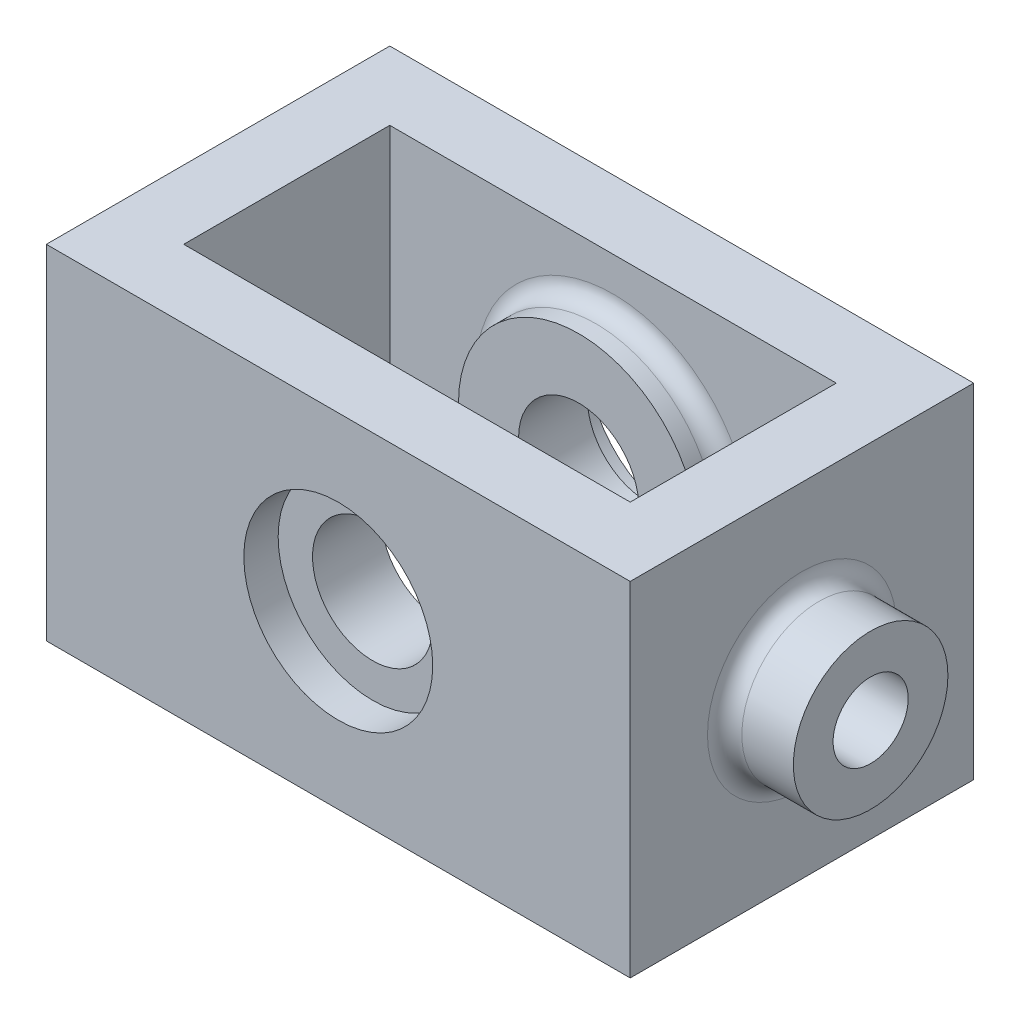
ISO-10303-21;
HEADER;
FILE_DESCRIPTION(('STEP AP214'),'2;1');
FILE_NAME('part.step','',(''),(''),'','','');
FILE_SCHEMA(('AUTOMOTIVE_DESIGN { 1 0 10303 214 1 1 1 1 }'));
ENDSEC;
DATA;
#1=APPLICATION_CONTEXT('core data for automotive mechanical design processes');
#2=APPLICATION_PROTOCOL_DEFINITION('international standard','automotive_design',2000,#1);
#3=PRODUCT_CONTEXT('',#1,'mechanical');
#4=PRODUCT('Part','Part','',(#3));
#5=PRODUCT_RELATED_PRODUCT_CATEGORY('part','',(#4));
#6=PRODUCT_DEFINITION_FORMATION('','',#4);
#7=PRODUCT_DEFINITION_CONTEXT('part definition',#1,'design');
#8=PRODUCT_DEFINITION('design','',#6,#7);
#9=PRODUCT_DEFINITION_SHAPE('','',#8);
#10=(LENGTH_UNIT() NAMED_UNIT(*) SI_UNIT(.MILLI.,.METRE.));
#11=(NAMED_UNIT(*) PLANE_ANGLE_UNIT() SI_UNIT($,.RADIAN.));
#12=(NAMED_UNIT(*) SI_UNIT($,.STERADIAN.) SOLID_ANGLE_UNIT());
#13=UNCERTAINTY_MEASURE_WITH_UNIT(LENGTH_MEASURE(1.E-05),#10,'distance_accuracy_value','');
#14=(GEOMETRIC_REPRESENTATION_CONTEXT(3) GLOBAL_UNCERTAINTY_ASSIGNED_CONTEXT((#13)) GLOBAL_UNIT_ASSIGNED_CONTEXT((#10,
#11,#12)) REPRESENTATION_CONTEXT('',''));
#15=CARTESIAN_POINT('',(0.,0.,0.));
#16=DIRECTION('',(0.,0.,1.));
#17=DIRECTION('',(1.,0.,0.));
#18=AXIS2_PLACEMENT_3D('',#15,#16,#17);
#19=CARTESIAN_POINT('',(0.,0.,25.4));
#20=DIRECTION('',(0.,0.,-1.));
#21=DIRECTION('',(-1.,0.,0.));
#22=AXIS2_PLACEMENT_3D('',#19,#20,#21);
#23=CYLINDRICAL_SURFACE('',#22,8.89);
#24=CARTESIAN_POINT('',(0.,0.,20.32));
#25=DIRECTION('',(0.,0.,1.));
#26=DIRECTION('',(1.,0.,0.));
#27=AXIS2_PLACEMENT_3D('',#24,#25,#26);
#28=CIRCLE('',#27,8.89);
#29=CARTESIAN_POINT('',(8.89000000000003,0.,20.32));
#30=VERTEX_POINT('',#29);
#31=EDGE_CURVE('E231',#30,#30,#28,.T.);
#32=ORIENTED_EDGE('',*,*,#31,.T.);
#33=EDGE_LOOP('',(#32));
#34=FACE_BOUND('',#33,.T.);
#35=CARTESIAN_POINT('',(0.,0.,10.16));
#36=DIRECTION('',(0.,0.,1.));
#37=DIRECTION('',(1.,0.,0.));
#38=AXIS2_PLACEMENT_3D('',#35,#36,#37);
#39=CIRCLE('',#38,8.89);
#40=CARTESIAN_POINT('',(8.89000000000003,0.,10.16));
#41=VERTEX_POINT('',#40);
#42=EDGE_CURVE('E368',#41,#41,#39,.T.);
#43=ORIENTED_EDGE('',*,*,#42,.F.);
#44=EDGE_LOOP('',(#43));
#45=FACE_BOUND('',#44,.T.);
#46=ADVANCED_FACE('F87',(#34,#45),#23,.F.);
#47=CARTESIAN_POINT('',(0.,0.,-25.4));
#48=DIRECTION('',(0.,0.,1.));
#49=DIRECTION('',(1.,0.,0.));
#50=AXIS2_PLACEMENT_3D('',#47,#48,#49);
#51=PLANE('',#50);
#52=DIRECTION('',(0.,-1.,0.));
#53=VECTOR('',#52,1.);
#54=CARTESIAN_POINT('',(43.18,0.,-25.4));
#55=LINE('',#54,#53);
#56=CARTESIAN_POINT('',(43.18,25.4,-25.4));
#57=VERTEX_POINT('',#56);
#58=CARTESIAN_POINT('',(43.18,-25.4,-25.4));
#59=VERTEX_POINT('',#58);
#60=EDGE_CURVE('E243',#57,#59,#55,.T.);
#61=ORIENTED_EDGE('',*,*,#60,.T.);
#62=DIRECTION('',(1.,0.,0.));
#63=VECTOR('',#62,1.);
#64=CARTESIAN_POINT('',(0.,-25.4,-25.4));
#65=LINE('',#64,#63);
#66=CARTESIAN_POINT('',(-43.18,-25.4,-25.4));
#67=VERTEX_POINT('',#66);
#68=EDGE_CURVE('E252',#67,#59,#65,.T.);
#69=ORIENTED_EDGE('',*,*,#68,.F.);
#70=DIRECTION('',(0.,-1.,0.));
#71=VECTOR('',#70,1.);
#72=CARTESIAN_POINT('',(-43.18,0.,-25.4));
#73=LINE('',#72,#71);
#74=CARTESIAN_POINT('',(-43.18,25.4,-25.4));
#75=VERTEX_POINT('',#74);
#76=EDGE_CURVE('E271',#75,#67,#73,.T.);
#77=ORIENTED_EDGE('',*,*,#76,.F.);
#78=DIRECTION('',(1.,0.,0.));
#79=VECTOR('',#78,1.);
#80=CARTESIAN_POINT('',(0.,25.4,-25.4));
#81=LINE('',#80,#79);
#82=EDGE_CURVE('E267',#75,#57,#81,.T.);
#83=ORIENTED_EDGE('',*,*,#82,.T.);
#84=EDGE_LOOP('',(#61,#69,#77,#83));
#85=FACE_BOUND('',#84,.T.);
#86=CARTESIAN_POINT('',(0.,0.,-25.4));
#87=DIRECTION('',(0.,0.,1.));
#88=DIRECTION('',(1.,0.,0.));
#89=AXIS2_PLACEMENT_3D('',#86,#87,#88);
#90=CIRCLE('',#89,13.97);
#91=CARTESIAN_POINT('',(13.97,0.,-25.4));
#92=VERTEX_POINT('',#91);
#93=EDGE_CURVE('E226',#92,#92,#90,.T.);
#94=ORIENTED_EDGE('',*,*,#93,.T.);
#95=EDGE_LOOP('',(#94));
#96=FACE_BOUND('',#95,.T.);
#97=ADVANCED_FACE('F336',(#85,#96),#51,.F.);
#98=CARTESIAN_POINT('',(0.,0.,-20.32));
#99=DIRECTION('',(0.,0.,1.));
#100=DIRECTION('',(1.,0.,0.));
#101=AXIS2_PLACEMENT_3D('',#98,#99,#100);
#102=CIRCLE('',#101,8.89);
#103=CARTESIAN_POINT('',(8.89000000000003,0.,-20.32));
#104=VERTEX_POINT('',#103);
#105=EDGE_CURVE('E222',#104,#104,#102,.T.);
#106=ORIENTED_EDGE('',*,*,#105,.F.);
#107=EDGE_LOOP('',(#106));
#108=FACE_BOUND('',#107,.T.);
#109=CARTESIAN_POINT('',(0.,0.,-10.16));
#110=DIRECTION('',(0.,0.,-1.));
#111=DIRECTION('',(-1.,0.,0.));
#112=AXIS2_PLACEMENT_3D('',#109,#110,#111);
#113=CIRCLE('',#112,8.89);
#114=CARTESIAN_POINT('',(-8.88999999999997,0.,-10.16));
#115=VERTEX_POINT('',#114);
#116=EDGE_CURVE('E361',#115,#115,#113,.T.);
#117=ORIENTED_EDGE('',*,*,#116,.F.);
#118=EDGE_LOOP('',(#117));
#119=FACE_BOUND('',#118,.T.);
#120=ADVANCED_FACE('F339',(#108,#119),#23,.F.);
#121=CARTESIAN_POINT('',(0.,25.4,25.4));
#122=DIRECTION('',(0.,1.,0.));
#123=DIRECTION('',(-1.,0.,0.));
#124=AXIS2_PLACEMENT_3D('',#121,#122,#123);
#125=PLANE('',#124);
#126=DIRECTION('',(0.,0.,-1.));
#127=VECTOR('',#126,1.);
#128=CARTESIAN_POINT('',(33.02,25.4,-15.24));
#129=LINE('',#128,#127);
#130=CARTESIAN_POINT('',(33.02,25.4,15.24));
#131=VERTEX_POINT('',#130);
#132=CARTESIAN_POINT('',(33.02,25.4,-15.24));
#133=VERTEX_POINT('',#132);
#134=EDGE_CURVE('E103',#131,#133,#129,.T.);
#135=ORIENTED_EDGE('',*,*,#134,.F.);
#136=DIRECTION('',(1.,0.,0.));
#137=VECTOR('',#136,1.);
#138=CARTESIAN_POINT('',(-33.02,25.4,15.24));
#139=LINE('',#138,#137);
#140=CARTESIAN_POINT('',(-33.02,25.4,15.24));
#141=VERTEX_POINT('',#140);
#142=EDGE_CURVE('E174',#141,#131,#139,.T.);
#143=ORIENTED_EDGE('',*,*,#142,.F.);
#144=DIRECTION('',(0.,0.,1.));
#145=VECTOR('',#144,1.);
#146=CARTESIAN_POINT('',(-33.02,25.4,-15.24));
#147=LINE('',#146,#145);
#148=CARTESIAN_POINT('',(-33.02,25.4,-15.24));
#149=VERTEX_POINT('',#148);
#150=EDGE_CURVE('E178',#149,#141,#147,.T.);
#151=ORIENTED_EDGE('',*,*,#150,.F.);
#152=DIRECTION('',(-1.,0.,0.));
#153=VECTOR('',#152,1.);
#154=CARTESIAN_POINT('',(-33.02,25.4,-15.24));
#155=LINE('',#154,#153);
#156=EDGE_CURVE('E190',#133,#149,#155,.T.);
#157=ORIENTED_EDGE('',*,*,#156,.F.);
#158=EDGE_LOOP('',(#135,#143,#151,#157));
#159=FACE_BOUND('',#158,.T.);
#160=ORIENTED_EDGE('',*,*,#82,.F.);
#161=DIRECTION('',(0.,0.,-1.));
#162=VECTOR('',#161,1.);
#163=CARTESIAN_POINT('',(-43.18,25.4,25.4));
#164=LINE('',#163,#162);
#165=CARTESIAN_POINT('',(-43.18,25.4,25.4));
#166=VERTEX_POINT('',#165);
#167=EDGE_CURVE('E284',#166,#75,#164,.T.);
#168=ORIENTED_EDGE('',*,*,#167,.F.);
#169=DIRECTION('',(1.,0.,0.));
#170=VECTOR('',#169,1.);
#171=CARTESIAN_POINT('',(0.,25.4,25.4));
#172=LINE('',#171,#170);
#173=CARTESIAN_POINT('',(43.18,25.4,25.4));
#174=VERTEX_POINT('',#173);
#175=EDGE_CURVE('E251',#166,#174,#172,.T.);
#176=ORIENTED_EDGE('',*,*,#175,.T.);
#177=DIRECTION('',(0.,0.,-1.));
#178=VECTOR('',#177,1.);
#179=CARTESIAN_POINT('',(43.18,25.4,25.4));
#180=LINE('',#179,#178);
#181=EDGE_CURVE('E287',#174,#57,#180,.T.);
#182=ORIENTED_EDGE('',*,*,#181,.T.);
#183=EDGE_LOOP('',(#160,#168,#176,#182));
#184=FACE_BOUND('',#183,.T.);
#185=ADVANCED_FACE('F349',(#159,#184),#125,.T.);
#186=CARTESIAN_POINT('',(-43.18,0.,25.4));
#187=DIRECTION('',(1.,0.,0.));
#188=DIRECTION('',(0.,1.,0.));
#189=AXIS2_PLACEMENT_3D('',#186,#187,#188);
#190=PLANE('',#189);
#191=CARTESIAN_POINT('',(-43.18,0.,0.));
#192=DIRECTION('',(1.,0.,0.));
#193=DIRECTION('',(0.,1.,0.));
#194=AXIS2_PLACEMENT_3D('',#191,#192,#193);
#195=CIRCLE('',#194,13.97);
#196=CARTESIAN_POINT('',(-43.18,13.97,0.));
#197=VERTEX_POINT('',#196);
#198=EDGE_CURVE('E312',#197,#197,#195,.T.);
#199=ORIENTED_EDGE('',*,*,#198,.T.);
#200=EDGE_LOOP('',(#199));
#201=FACE_BOUND('',#200,.T.);
#202=ORIENTED_EDGE('',*,*,#76,.T.);
#203=DIRECTION('',(0.,0.,-1.));
#204=VECTOR('',#203,1.);
#205=CARTESIAN_POINT('',(-43.18,-25.4,25.4));
#206=LINE('',#205,#204);
#207=CARTESIAN_POINT('',(-43.18,-25.4,25.4));
#208=VERTEX_POINT('',#207);
#209=EDGE_CURVE('E280',#208,#67,#206,.T.);
#210=ORIENTED_EDGE('',*,*,#209,.F.);
#211=DIRECTION('',(0.,-1.,0.));
#212=VECTOR('',#211,1.);
#213=CARTESIAN_POINT('',(-43.18,0.,25.4));
#214=LINE('',#213,#212);
#215=EDGE_CURVE('E256',#166,#208,#214,.T.);
#216=ORIENTED_EDGE('',*,*,#215,.F.);
#217=ORIENTED_EDGE('',*,*,#167,.T.);
#218=EDGE_LOOP('',(#202,#210,#216,#217));
#219=FACE_BOUND('',#218,.T.);
#220=ADVANCED_FACE('F354',(#201,#219),#190,.F.);
#221=CARTESIAN_POINT('',(0.,-25.4,25.4));
#222=DIRECTION('',(0.,1.,0.));
#223=DIRECTION('',(0.,0.,1.));
#224=AXIS2_PLACEMENT_3D('',#221,#222,#223);
#225=PLANE('',#224);
#226=DIRECTION('',(1.,0.,0.));
#227=VECTOR('',#226,1.);
#228=CARTESIAN_POINT('',(-33.02,-25.4,15.24));
#229=LINE('',#228,#227);
#230=CARTESIAN_POINT('',(-33.02,-25.4,15.24));
#231=VERTEX_POINT('',#230);
#232=CARTESIAN_POINT('',(33.02,-25.4,15.24));
#233=VERTEX_POINT('',#232);
#234=EDGE_CURVE('E162',#231,#233,#229,.T.);
#235=ORIENTED_EDGE('',*,*,#234,.T.);
#236=DIRECTION('',(0.,0.,-1.));
#237=VECTOR('',#236,1.);
#238=CARTESIAN_POINT('',(33.02,-25.4,-15.24));
#239=LINE('',#238,#237);
#240=CARTESIAN_POINT('',(33.02,-25.4,-15.24));
#241=VERTEX_POINT('',#240);
#242=EDGE_CURVE('E155',#233,#241,#239,.T.);
#243=ORIENTED_EDGE('',*,*,#242,.T.);
#244=DIRECTION('',(-1.,0.,0.));
#245=VECTOR('',#244,1.);
#246=CARTESIAN_POINT('',(-33.02,-25.4,-15.24));
#247=LINE('',#246,#245);
#248=CARTESIAN_POINT('',(-33.02,-25.4,-15.24));
#249=VERTEX_POINT('',#248);
#250=EDGE_CURVE('E165',#241,#249,#247,.T.);
#251=ORIENTED_EDGE('',*,*,#250,.T.);
#252=DIRECTION('',(0.,0.,1.));
#253=VECTOR('',#252,1.);
#254=CARTESIAN_POINT('',(-33.02,-25.4,-15.24));
#255=LINE('',#254,#253);
#256=EDGE_CURVE('E111',#249,#231,#255,.T.);
#257=ORIENTED_EDGE('',*,*,#256,.T.);
#258=EDGE_LOOP('',(#235,#243,#251,#257));
#259=FACE_BOUND('',#258,.T.);
#260=ORIENTED_EDGE('',*,*,#68,.T.);
#261=DIRECTION('',(0.,0.,-1.));
#262=VECTOR('',#261,1.);
#263=CARTESIAN_POINT('',(43.18,-25.4,25.4));
#264=LINE('',#263,#262);
#265=CARTESIAN_POINT('',(43.18,-25.4,25.4));
#266=VERTEX_POINT('',#265);
#267=EDGE_CURVE('E263',#266,#59,#264,.T.);
#268=ORIENTED_EDGE('',*,*,#267,.F.);
#269=DIRECTION('',(1.,0.,0.));
#270=VECTOR('',#269,1.);
#271=CARTESIAN_POINT('',(0.,-25.4,25.4));
#272=LINE('',#271,#270);
#273=EDGE_CURVE('E260',#208,#266,#272,.T.);
#274=ORIENTED_EDGE('',*,*,#273,.F.);
#275=ORIENTED_EDGE('',*,*,#209,.T.);
#276=EDGE_LOOP('',(#260,#268,#274,#275));
#277=FACE_BOUND('',#276,.T.);
#278=ADVANCED_FACE('F170',(#259,#277),#225,.F.);
#279=CARTESIAN_POINT('',(43.18,0.,25.4));
#280=DIRECTION('',(1.,0.,0.));
#281=DIRECTION('',(0.,0.,-1.));
#282=AXIS2_PLACEMENT_3D('',#279,#280,#281);
#283=PLANE('',#282);
#284=CARTESIAN_POINT('',(43.18,0.,0.));
#285=DIRECTION('',(1.,0.,0.));
#286=DIRECTION('',(0.,0.,-1.));
#287=AXIS2_PLACEMENT_3D('',#284,#285,#286);
#288=CIRCLE('',#287,13.97);
#289=CARTESIAN_POINT('',(43.18,0.,-13.97));
#290=VERTEX_POINT('',#289);
#291=EDGE_CURVE('E12',#290,#290,#288,.F.);
#292=ORIENTED_EDGE('',*,*,#291,.T.);
#293=EDGE_LOOP('',(#292));
#294=FACE_BOUND('',#293,.T.);
#295=ORIENTED_EDGE('',*,*,#60,.F.);
#296=ORIENTED_EDGE('',*,*,#181,.F.);
#297=DIRECTION('',(0.,-1.,0.));
#298=VECTOR('',#297,1.);
#299=CARTESIAN_POINT('',(43.18,0.,25.4));
#300=LINE('',#299,#298);
#301=EDGE_CURVE('E247',#174,#266,#300,.T.);
#302=ORIENTED_EDGE('',*,*,#301,.T.);
#303=ORIENTED_EDGE('',*,*,#267,.T.);
#304=EDGE_LOOP('',(#295,#296,#302,#303));
#305=FACE_BOUND('',#304,.T.);
#306=ADVANCED_FACE('F448',(#294,#305),#283,.T.);
#307=CARTESIAN_POINT('',(0.,0.,25.4));
#308=DIRECTION('',(0.,0.,1.));
#309=DIRECTION('',(1.,0.,0.));
#310=AXIS2_PLACEMENT_3D('',#307,#308,#309);
#311=PLANE('',#310);
#312=CARTESIAN_POINT('',(0.,0.,25.4));
#313=DIRECTION('',(0.,0.,1.));
#314=DIRECTION('',(1.,0.,0.));
#315=AXIS2_PLACEMENT_3D('',#312,#313,#314);
#316=CIRCLE('',#315,13.97);
#317=CARTESIAN_POINT('',(13.97,0.,25.4));
#318=VERTEX_POINT('',#317);
#319=EDGE_CURVE('E238',#318,#318,#316,.T.);
#320=ORIENTED_EDGE('',*,*,#319,.F.);
#321=EDGE_LOOP('',(#320));
#322=FACE_BOUND('',#321,.T.);
#323=ORIENTED_EDGE('',*,*,#301,.F.);
#324=ORIENTED_EDGE('',*,*,#175,.F.);
#325=ORIENTED_EDGE('',*,*,#215,.T.);
#326=ORIENTED_EDGE('',*,*,#273,.T.);
#327=EDGE_LOOP('',(#323,#324,#325,#326));
#328=FACE_BOUND('',#327,.T.);
#329=ADVANCED_FACE('F445',(#322,#328),#311,.T.);
#330=CARTESIAN_POINT('',(0.,0.,20.32));
#331=DIRECTION('',(0.,0.,1.));
#332=DIRECTION('',(1.,0.,0.));
#333=AXIS2_PLACEMENT_3D('',#330,#331,#332);
#334=CYLINDRICAL_SURFACE('',#333,13.97);
#335=CARTESIAN_POINT('',(0.,0.,20.32));
#336=DIRECTION('',(0.,0.,1.));
#337=DIRECTION('',(1.,0.,0.));
#338=AXIS2_PLACEMENT_3D('',#335,#336,#337);
#339=CIRCLE('',#338,13.97);
#340=CARTESIAN_POINT('',(13.97,0.,20.32));
#341=VERTEX_POINT('',#340);
#342=EDGE_CURVE('E239',#341,#341,#339,.T.);
#343=ORIENTED_EDGE('',*,*,#342,.F.);
#344=EDGE_LOOP('',(#343));
#345=FACE_BOUND('',#344,.T.);
#346=ORIENTED_EDGE('',*,*,#319,.T.);
#347=EDGE_LOOP('',(#346));
#348=FACE_BOUND('',#347,.T.);
#349=ADVANCED_FACE('F441',(#345,#348),#334,.F.);
#350=CARTESIAN_POINT('',(0.,0.,20.32));
#351=DIRECTION('',(0.,0.,1.));
#352=DIRECTION('',(1.,0.,0.));
#353=AXIS2_PLACEMENT_3D('',#350,#351,#352);
#354=PLANE('',#353);
#355=ORIENTED_EDGE('',*,*,#31,.F.);
#356=EDGE_LOOP('',(#355));
#357=FACE_BOUND('',#356,.T.);
#358=ORIENTED_EDGE('',*,*,#342,.T.);
#359=EDGE_LOOP('',(#358));
#360=FACE_BOUND('',#359,.T.);
#361=ADVANCED_FACE('F434',(#357,#360),#354,.T.);
#362=CARTESIAN_POINT('',(0.,0.,-20.32));
#363=DIRECTION('',(0.,0.,1.));
#364=DIRECTION('',(1.,0.,0.));
#365=AXIS2_PLACEMENT_3D('',#362,#363,#364);
#366=PLANE('',#365);
#367=CARTESIAN_POINT('',(0.,0.,-20.32));
#368=DIRECTION('',(0.,0.,1.));
#369=DIRECTION('',(1.,0.,0.));
#370=AXIS2_PLACEMENT_3D('',#367,#368,#369);
#371=CIRCLE('',#370,13.97);
#372=CARTESIAN_POINT('',(13.97,0.,-20.32));
#373=VERTEX_POINT('',#372);
#374=EDGE_CURVE('E227',#373,#373,#371,.T.);
#375=ORIENTED_EDGE('',*,*,#374,.F.);
#376=EDGE_LOOP('',(#375));
#377=FACE_BOUND('',#376,.T.);
#378=ORIENTED_EDGE('',*,*,#105,.T.);
#379=EDGE_LOOP('',(#378));
#380=FACE_BOUND('',#379,.T.);
#381=ADVANCED_FACE('F431',(#377,#380),#366,.F.);
#382=CARTESIAN_POINT('',(0.,0.,-20.32));
#383=DIRECTION('',(0.,0.,-1.));
#384=DIRECTION('',(-1.,0.,0.));
#385=AXIS2_PLACEMENT_3D('',#382,#383,#384);
#386=CYLINDRICAL_SURFACE('',#385,13.97);
#387=ORIENTED_EDGE('',*,*,#374,.T.);
#388=EDGE_LOOP('',(#387));
#389=FACE_BOUND('',#388,.T.);
#390=ORIENTED_EDGE('',*,*,#93,.F.);
#391=EDGE_LOOP('',(#390));
#392=FACE_BOUND('',#391,.T.);
#393=ADVANCED_FACE('F427',(#389,#392),#386,.F.);
#394=CARTESIAN_POINT('',(53.34,0.,0.));
#395=DIRECTION('',(1.,0.,0.));
#396=DIRECTION('',(0.,0.,-1.));
#397=AXIS2_PLACEMENT_3D('',#394,#395,#396);
#398=PLANE('',#397);
#399=CARTESIAN_POINT('',(53.34,0.,0.));
#400=DIRECTION('',(1.,0.,0.));
#401=DIRECTION('',(0.,0.,-1.));
#402=AXIS2_PLACEMENT_3D('',#399,#400,#401);
#403=CIRCLE('',#402,11.43);
#404=CARTESIAN_POINT('',(53.34,0.,-11.43));
#405=VERTEX_POINT('',#404);
#406=EDGE_CURVE('E218',#405,#405,#403,.T.);
#407=ORIENTED_EDGE('',*,*,#406,.T.);
#408=EDGE_LOOP('',(#407));
#409=FACE_BOUND('',#408,.T.);
#410=CARTESIAN_POINT('',(53.34,0.,0.));
#411=DIRECTION('',(1.,0.,0.));
#412=DIRECTION('',(0.,0.,-1.));
#413=AXIS2_PLACEMENT_3D('',#410,#411,#412);
#414=CIRCLE('',#413,5.55625);
#415=CARTESIAN_POINT('',(53.34,0.,-5.55625));
#416=VERTEX_POINT('',#415);
#417=EDGE_CURVE('E214',#416,#416,#414,.T.);
#418=ORIENTED_EDGE('',*,*,#417,.F.);
#419=EDGE_LOOP('',(#418));
#420=FACE_BOUND('',#419,.T.);
#421=ADVANCED_FACE('F424',(#409,#420),#398,.T.);
#422=CARTESIAN_POINT('',(53.34,0.,0.));
#423=DIRECTION('',(-1.,0.,0.));
#424=DIRECTION('',(0.,0.,1.));
#425=AXIS2_PLACEMENT_3D('',#422,#423,#424);
#426=CYLINDRICAL_SURFACE('',#425,11.43);
#427=CARTESIAN_POINT('',(45.72,0.,0.));
#428=DIRECTION('',(1.,0.,0.));
#429=DIRECTION('',(0.,0.,-1.));
#430=AXIS2_PLACEMENT_3D('',#427,#428,#429);
#431=CIRCLE('',#430,11.43);
#432=CARTESIAN_POINT('',(45.72,0.,-11.43));
#433=VERTEX_POINT('',#432);
#434=EDGE_CURVE('E96',#433,#433,#431,.T.);
#435=ORIENTED_EDGE('',*,*,#434,.T.);
#436=EDGE_LOOP('',(#435));
#437=FACE_BOUND('',#436,.T.);
#438=ORIENTED_EDGE('',*,*,#406,.F.);
#439=EDGE_LOOP('',(#438));
#440=FACE_BOUND('',#439,.T.);
#441=ADVANCED_FACE('F323',(#437,#440),#426,.T.);
#442=CARTESIAN_POINT('',(53.34,0.,0.));
#443=DIRECTION('',(-1.,0.,0.));
#444=DIRECTION('',(0.,0.,1.));
#445=AXIS2_PLACEMENT_3D('',#442,#443,#444);
#446=CYLINDRICAL_SURFACE('',#445,5.55625);
#447=CARTESIAN_POINT('',(33.02,0.,0.));
#448=DIRECTION('',(1.,0.,0.));
#449=DIRECTION('',(0.,1.,0.));
#450=AXIS2_PLACEMENT_3D('',#447,#448,#449);
#451=CIRCLE('',#450,5.55625);
#452=CARTESIAN_POINT('',(33.02,5.55625,0.));
#453=VERTEX_POINT('',#452);
#454=EDGE_CURVE('E210',#453,#453,#451,.T.);
#455=ORIENTED_EDGE('',*,*,#454,.F.);
#456=EDGE_LOOP('',(#455));
#457=FACE_BOUND('',#456,.T.);
#458=ORIENTED_EDGE('',*,*,#417,.T.);
#459=EDGE_LOOP('',(#458));
#460=FACE_BOUND('',#459,.T.);
#461=ADVANCED_FACE('F419',(#457,#460),#446,.F.);
#462=CARTESIAN_POINT('',(-53.34,0.,0.));
#463=DIRECTION('',(1.,0.,0.));
#464=DIRECTION('',(0.,0.,-1.));
#465=AXIS2_PLACEMENT_3D('',#462,#463,#464);
#466=CYLINDRICAL_SURFACE('',#465,11.43);
#467=CARTESIAN_POINT('',(-45.72,0.,0.));
#468=DIRECTION('',(1.,0.,0.));
#469=DIRECTION('',(0.,1.,0.));
#470=AXIS2_PLACEMENT_3D('',#467,#468,#469);
#471=CIRCLE('',#470,11.43);
#472=CARTESIAN_POINT('',(-45.72,11.43,0.));
#473=VERTEX_POINT('',#472);
#474=EDGE_CURVE('E316',#473,#473,#471,.F.);
#475=ORIENTED_EDGE('',*,*,#474,.T.);
#476=EDGE_LOOP('',(#475));
#477=FACE_BOUND('',#476,.T.);
#478=CARTESIAN_POINT('',(-53.34,0.,0.));
#479=DIRECTION('',(1.,0.,0.));
#480=DIRECTION('',(0.,0.,-1.));
#481=AXIS2_PLACEMENT_3D('',#478,#479,#480);
#482=CIRCLE('',#481,11.43);
#483=CARTESIAN_POINT('',(-53.34,0.,-11.43));
#484=VERTEX_POINT('',#483);
#485=EDGE_CURVE('E209',#484,#484,#482,.T.);
#486=ORIENTED_EDGE('',*,*,#485,.T.);
#487=EDGE_LOOP('',(#486));
#488=FACE_BOUND('',#487,.T.);
#489=ADVANCED_FACE('F415',(#477,#488),#466,.T.);
#490=CARTESIAN_POINT('',(-53.34,0.,0.));
#491=DIRECTION('',(-1.,0.,0.));
#492=DIRECTION('',(0.,0.,-1.));
#493=AXIS2_PLACEMENT_3D('',#490,#491,#492);
#494=PLANE('',#493);
#495=CARTESIAN_POINT('',(-53.34,0.,0.));
#496=DIRECTION('',(1.,0.,0.));
#497=DIRECTION('',(0.,0.,-1.));
#498=AXIS2_PLACEMENT_3D('',#495,#496,#497);
#499=CIRCLE('',#498,5.55625);
#500=CARTESIAN_POINT('',(-53.34,0.,-5.55625));
#501=VERTEX_POINT('',#500);
#502=EDGE_CURVE('E205',#501,#501,#499,.T.);
#503=ORIENTED_EDGE('',*,*,#502,.T.);
#504=EDGE_LOOP('',(#503));
#505=FACE_BOUND('',#504,.T.);
#506=ORIENTED_EDGE('',*,*,#485,.F.);
#507=EDGE_LOOP('',(#506));
#508=FACE_BOUND('',#507,.T.);
#509=ADVANCED_FACE('F411',(#505,#508),#494,.T.);
#510=CARTESIAN_POINT('',(-53.34,0.,0.));
#511=DIRECTION('',(1.,0.,0.));
#512=DIRECTION('',(0.,0.,-1.));
#513=AXIS2_PLACEMENT_3D('',#510,#511,#512);
#514=CYLINDRICAL_SURFACE('',#513,5.55625);
#515=CARTESIAN_POINT('',(-33.02,0.,0.));
#516=DIRECTION('',(-1.,0.,0.));
#517=DIRECTION('',(0.,-1.,0.));
#518=AXIS2_PLACEMENT_3D('',#515,#516,#517);
#519=CIRCLE('',#518,5.55625);
#520=CARTESIAN_POINT('',(-33.02,-5.55625,0.));
#521=VERTEX_POINT('',#520);
#522=EDGE_CURVE('E199',#521,#521,#519,.F.);
#523=ORIENTED_EDGE('',*,*,#522,.T.);
#524=EDGE_LOOP('',(#523));
#525=FACE_BOUND('',#524,.T.);
#526=ORIENTED_EDGE('',*,*,#502,.F.);
#527=EDGE_LOOP('',(#526));
#528=FACE_BOUND('',#527,.T.);
#529=ADVANCED_FACE('F402',(#525,#528),#514,.F.);
#530=CARTESIAN_POINT('',(-33.02,-25.4,-15.24));
#531=DIRECTION('',(-1.,0.,0.));
#532=DIRECTION('',(0.,-1.,0.));
#533=AXIS2_PLACEMENT_3D('',#530,#531,#532);
#534=PLANE('',#533);
#535=ORIENTED_EDGE('',*,*,#150,.T.);
#536=DIRECTION('',(0.,1.,0.));
#537=VECTOR('',#536,1.);
#538=CARTESIAN_POINT('',(-33.02,-25.4,15.24));
#539=LINE('',#538,#537);
#540=EDGE_CURVE('E200',#231,#141,#539,.T.);
#541=ORIENTED_EDGE('',*,*,#540,.F.);
#542=ORIENTED_EDGE('',*,*,#256,.F.);
#543=DIRECTION('',(0.,1.,0.));
#544=VECTOR('',#543,1.);
#545=CARTESIAN_POINT('',(-33.02,-25.4,-15.24));
#546=LINE('',#545,#544);
#547=EDGE_CURVE('E161',#249,#149,#546,.T.);
#548=ORIENTED_EDGE('',*,*,#547,.T.);
#549=EDGE_LOOP('',(#535,#541,#542,#548));
#550=FACE_BOUND('',#549,.T.);
#551=ORIENTED_EDGE('',*,*,#522,.F.);
#552=EDGE_LOOP('',(#551));
#553=FACE_BOUND('',#552,.T.);
#554=ADVANCED_FACE('F399',(#550,#553),#534,.F.);
#555=CARTESIAN_POINT('',(33.02,-25.4,-15.24));
#556=DIRECTION('',(1.,0.,0.));
#557=DIRECTION('',(0.,1.,0.));
#558=AXIS2_PLACEMENT_3D('',#555,#556,#557);
#559=PLANE('',#558);
#560=ORIENTED_EDGE('',*,*,#454,.T.);
#561=EDGE_LOOP('',(#560));
#562=FACE_BOUND('',#561,.T.);
#563=ORIENTED_EDGE('',*,*,#134,.T.);
#564=DIRECTION('',(0.,1.,0.));
#565=VECTOR('',#564,1.);
#566=CARTESIAN_POINT('',(33.02,-25.4,-15.24));
#567=LINE('',#566,#565);
#568=EDGE_CURVE('E151',#241,#133,#567,.T.);
#569=ORIENTED_EDGE('',*,*,#568,.F.);
#570=ORIENTED_EDGE('',*,*,#242,.F.);
#571=DIRECTION('',(0.,1.,0.));
#572=VECTOR('',#571,1.);
#573=CARTESIAN_POINT('',(33.02,-25.4,15.24));
#574=LINE('',#573,#572);
#575=EDGE_CURVE('E196',#233,#131,#574,.T.);
#576=ORIENTED_EDGE('',*,*,#575,.T.);
#577=EDGE_LOOP('',(#563,#569,#570,#576));
#578=FACE_BOUND('',#577,.T.);
#579=ADVANCED_FACE('F153',(#562,#578),#559,.F.);
#580=CARTESIAN_POINT('',(-33.02,-25.4,15.24));
#581=DIRECTION('',(0.,0.,1.));
#582=DIRECTION('',(1.,0.,0.));
#583=AXIS2_PLACEMENT_3D('',#580,#581,#582);
#584=PLANE('',#583);
#585=CARTESIAN_POINT('',(0.,0.,15.24));
#586=DIRECTION('',(0.,0.,1.));
#587=DIRECTION('',(1.,0.,0.));
#588=AXIS2_PLACEMENT_3D('',#585,#586,#587);
#589=CIRCLE('',#588,20.32);
#590=CARTESIAN_POINT('',(20.32,0.,15.24));
#591=VERTEX_POINT('',#590);
#592=EDGE_CURVE('E290',#591,#591,#589,.T.);
#593=ORIENTED_EDGE('',*,*,#592,.T.);
#594=EDGE_LOOP('',(#593));
#595=FACE_BOUND('',#594,.T.);
#596=ORIENTED_EDGE('',*,*,#142,.T.);
#597=ORIENTED_EDGE('',*,*,#575,.F.);
#598=ORIENTED_EDGE('',*,*,#234,.F.);
#599=ORIENTED_EDGE('',*,*,#540,.T.);
#600=EDGE_LOOP('',(#596,#597,#598,#599));
#601=FACE_BOUND('',#600,.T.);
#602=ADVANCED_FACE('F395',(#595,#601),#584,.F.);
#603=CARTESIAN_POINT('',(-33.02,-25.4,-15.24));
#604=DIRECTION('',(0.,0.,-1.));
#605=DIRECTION('',(-1.,0.,0.));
#606=AXIS2_PLACEMENT_3D('',#603,#604,#605);
#607=PLANE('',#606);
#608=CARTESIAN_POINT('',(0.,0.,-15.24));
#609=DIRECTION('',(0.,0.,-1.));
#610=DIRECTION('',(-1.,0.,0.));
#611=AXIS2_PLACEMENT_3D('',#608,#609,#610);
#612=CIRCLE('',#611,20.32);
#613=CARTESIAN_POINT('',(-20.32,0.,-15.24));
#614=VERTEX_POINT('',#613);
#615=EDGE_CURVE('E304',#614,#614,#612,.T.);
#616=ORIENTED_EDGE('',*,*,#615,.T.);
#617=EDGE_LOOP('',(#616));
#618=FACE_BOUND('',#617,.T.);
#619=ORIENTED_EDGE('',*,*,#156,.T.);
#620=ORIENTED_EDGE('',*,*,#547,.F.);
#621=ORIENTED_EDGE('',*,*,#250,.F.);
#622=ORIENTED_EDGE('',*,*,#568,.T.);
#623=EDGE_LOOP('',(#619,#620,#621,#622));
#624=FACE_BOUND('',#623,.T.);
#625=ADVANCED_FACE('F166',(#618,#624),#607,.F.);
#626=CARTESIAN_POINT('',(0.,0.,10.16));
#627=DIRECTION('',(0.,0.,1.));
#628=DIRECTION('',(1.,0.,0.));
#629=AXIS2_PLACEMENT_3D('',#626,#627,#628);
#630=CYLINDRICAL_SURFACE('',#629,17.78);
#631=CARTESIAN_POINT('',(0.,0.,12.7));
#632=DIRECTION('',(0.,0.,1.));
#633=DIRECTION('',(1.,0.,0.));
#634=AXIS2_PLACEMENT_3D('',#631,#632,#633);
#635=CIRCLE('',#634,17.78);
#636=CARTESIAN_POINT('',(17.78,0.,12.7));
#637=VERTEX_POINT('',#636);
#638=EDGE_CURVE('E300',#637,#637,#635,.F.);
#639=ORIENTED_EDGE('',*,*,#638,.T.);
#640=EDGE_LOOP('',(#639));
#641=FACE_BOUND('',#640,.T.);
#642=CARTESIAN_POINT('',(0.,0.,10.16));
#643=DIRECTION('',(0.,0.,1.));
#644=DIRECTION('',(1.,0.,0.));
#645=AXIS2_PLACEMENT_3D('',#642,#643,#644);
#646=CIRCLE('',#645,17.78);
#647=CARTESIAN_POINT('',(17.78,0.,10.16));
#648=VERTEX_POINT('',#647);
#649=EDGE_CURVE('E181',#648,#648,#646,.T.);
#650=ORIENTED_EDGE('',*,*,#649,.T.);
#651=EDGE_LOOP('',(#650));
#652=FACE_BOUND('',#651,.T.);
#653=ADVANCED_FACE('F378',(#641,#652),#630,.T.);
#654=CARTESIAN_POINT('',(0.,0.,10.16));
#655=DIRECTION('',(0.,0.,1.));
#656=DIRECTION('',(1.,0.,0.));
#657=AXIS2_PLACEMENT_3D('',#654,#655,#656);
#658=PLANE('',#657);
#659=ORIENTED_EDGE('',*,*,#42,.T.);
#660=EDGE_LOOP('',(#659));
#661=FACE_BOUND('',#660,.T.);
#662=ORIENTED_EDGE('',*,*,#649,.F.);
#663=EDGE_LOOP('',(#662));
#664=FACE_BOUND('',#663,.T.);
#665=ADVANCED_FACE('F380',(#661,#664),#658,.F.);
#666=CARTESIAN_POINT('',(0.,0.,-10.16));
#667=DIRECTION('',(0.,0.,-1.));
#668=DIRECTION('',(-1.,0.,0.));
#669=AXIS2_PLACEMENT_3D('',#666,#667,#668);
#670=CYLINDRICAL_SURFACE('',#669,17.78);
#671=CARTESIAN_POINT('',(0.,0.,-12.7));
#672=DIRECTION('',(0.,0.,-1.));
#673=DIRECTION('',(-1.,0.,0.));
#674=AXIS2_PLACEMENT_3D('',#671,#672,#673);
#675=CIRCLE('',#674,17.78);
#676=CARTESIAN_POINT('',(-17.78,0.,-12.7));
#677=VERTEX_POINT('',#676);
#678=EDGE_CURVE('E308',#677,#677,#675,.F.);
#679=ORIENTED_EDGE('',*,*,#678,.T.);
#680=EDGE_LOOP('',(#679));
#681=FACE_BOUND('',#680,.T.);
#682=CARTESIAN_POINT('',(0.,0.,-10.16));
#683=DIRECTION('',(0.,0.,-1.));
#684=DIRECTION('',(-1.,0.,0.));
#685=AXIS2_PLACEMENT_3D('',#682,#683,#684);
#686=CIRCLE('',#685,17.78);
#687=CARTESIAN_POINT('',(-17.78,0.,-10.16));
#688=VERTEX_POINT('',#687);
#689=EDGE_CURVE('E364',#688,#688,#686,.T.);
#690=ORIENTED_EDGE('',*,*,#689,.T.);
#691=EDGE_LOOP('',(#690));
#692=FACE_BOUND('',#691,.T.);
#693=ADVANCED_FACE('F382',(#681,#692),#670,.T.);
#694=CARTESIAN_POINT('',(0.,0.,-10.16));
#695=DIRECTION('',(0.,0.,-1.));
#696=DIRECTION('',(-1.,0.,0.));
#697=AXIS2_PLACEMENT_3D('',#694,#695,#696);
#698=PLANE('',#697);
#699=ORIENTED_EDGE('',*,*,#116,.T.);
#700=EDGE_LOOP('',(#699));
#701=FACE_BOUND('',#700,.T.);
#702=ORIENTED_EDGE('',*,*,#689,.F.);
#703=EDGE_LOOP('',(#702));
#704=FACE_BOUND('',#703,.T.);
#705=ADVANCED_FACE('F388',(#701,#704),#698,.F.);
#706=CARTESIAN_POINT('',(0.,0.,12.7));
#707=DIRECTION('',(0.,0.,1.));
#708=DIRECTION('',(1.,0.,0.));
#709=AXIS2_PLACEMENT_3D('',#706,#707,#708);
#710=TOROIDAL_SURFACE('',#709,20.32,2.54);
#711=ORIENTED_EDGE('',*,*,#638,.F.);
#712=EDGE_LOOP('',(#711));
#713=FACE_BOUND('',#712,.T.);
#714=ORIENTED_EDGE('',*,*,#592,.F.);
#715=EDGE_LOOP('',(#714));
#716=FACE_BOUND('',#715,.T.);
#717=ADVANCED_FACE('F561',(#713,#716),#710,.F.);
#718=CARTESIAN_POINT('',(0.,0.,-12.7));
#719=DIRECTION('',(0.,0.,-1.));
#720=DIRECTION('',(-1.,0.,0.));
#721=AXIS2_PLACEMENT_3D('',#718,#719,#720);
#722=TOROIDAL_SURFACE('',#721,20.32,2.54);
#723=ORIENTED_EDGE('',*,*,#678,.F.);
#724=EDGE_LOOP('',(#723));
#725=FACE_BOUND('',#724,.T.);
#726=ORIENTED_EDGE('',*,*,#615,.F.);
#727=EDGE_LOOP('',(#726));
#728=FACE_BOUND('',#727,.T.);
#729=ADVANCED_FACE('F332',(#725,#728),#722,.F.);
#730=CARTESIAN_POINT('',(-45.72,0.,0.));
#731=DIRECTION('',(1.,0.,0.));
#732=DIRECTION('',(0.,1.,0.));
#733=AXIS2_PLACEMENT_3D('',#730,#731,#732);
#734=TOROIDAL_SURFACE('',#733,13.97,2.54);
#735=ORIENTED_EDGE('',*,*,#474,.F.);
#736=EDGE_LOOP('',(#735));
#737=FACE_BOUND('',#736,.T.);
#738=ORIENTED_EDGE('',*,*,#198,.F.);
#739=EDGE_LOOP('',(#738));
#740=FACE_BOUND('',#739,.T.);
#741=ADVANCED_FACE('F327',(#737,#740),#734,.F.);
#742=CARTESIAN_POINT('',(45.72,0.,0.));
#743=DIRECTION('',(1.,0.,0.));
#744=DIRECTION('',(0.,0.,-1.));
#745=AXIS2_PLACEMENT_3D('',#742,#743,#744);
#746=TOROIDAL_SURFACE('',#745,13.97,2.54);
#747=ORIENTED_EDGE('',*,*,#291,.F.);
#748=EDGE_LOOP('',(#747));
#749=FACE_BOUND('',#748,.T.);
#750=ORIENTED_EDGE('',*,*,#434,.F.);
#751=EDGE_LOOP('',(#750));
#752=FACE_BOUND('',#751,.T.);
#753=ADVANCED_FACE('F89',(#749,#752),#746,.F.);
#754=CLOSED_SHELL('',(#46,#97,#120,#185,#220,#278,#306,#329,#349,#361,#381,#393,#421,#441,#461,
#489,#509,#529,#554,#579,#602,#625,#653,#665,#693,#705,#717,#729,#741,#753));
#755=MANIFOLD_SOLID_BREP('B2',#754);
#756=ADVANCED_BREP_SHAPE_REPRESENTATION('',(#18,#755),#14);
#757=SHAPE_DEFINITION_REPRESENTATION(#9,#756);
ENDSEC;
END-ISO-10303-21;
